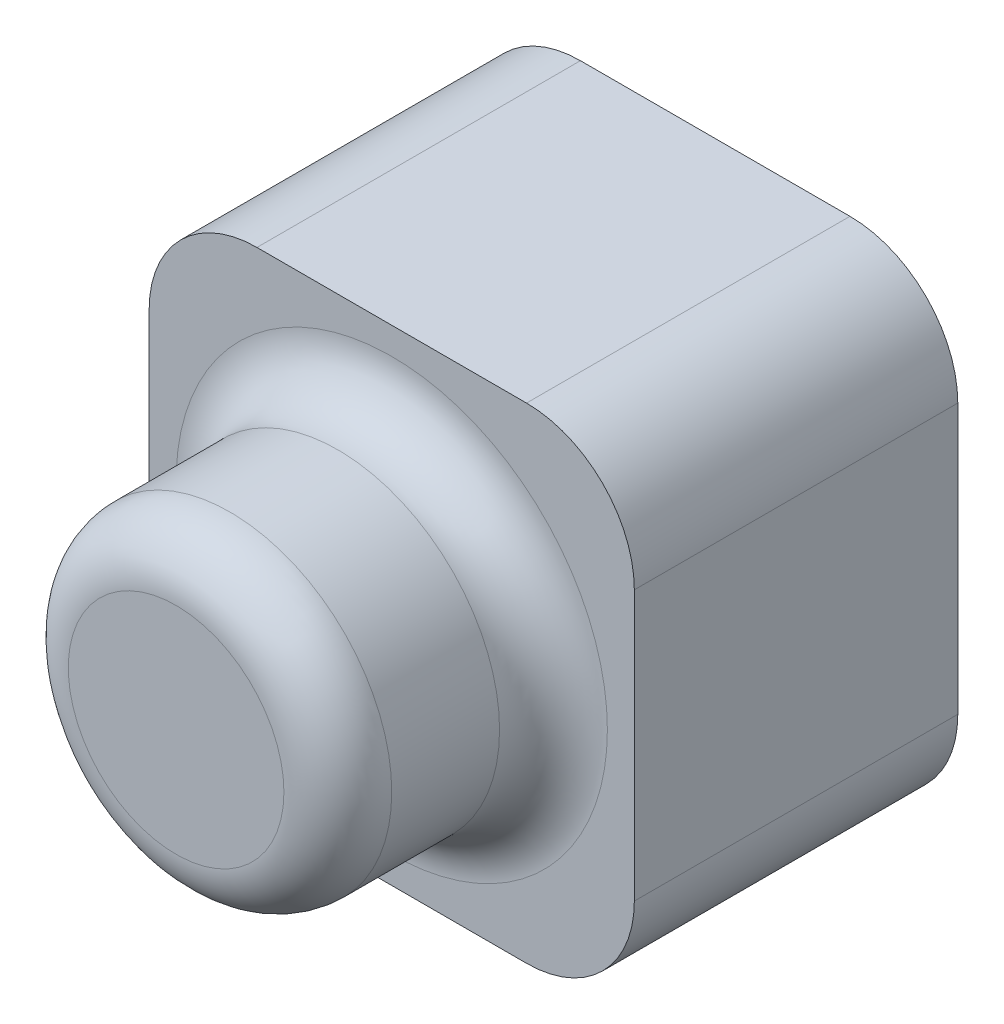
ISO-10303-21;
HEADER;
FILE_DESCRIPTION(('STEP AP214'),'2;1');
FILE_NAME('part.step','',(''),(''),'','','');
FILE_SCHEMA(('AUTOMOTIVE_DESIGN { 1 0 10303 214 1 1 1 1 }'));
ENDSEC;
DATA;
#1=APPLICATION_CONTEXT('core data for automotive mechanical design processes');
#2=APPLICATION_PROTOCOL_DEFINITION('international standard','automotive_design',2000,#1);
#3=PRODUCT_CONTEXT('',#1,'mechanical');
#4=PRODUCT('Part','Part','',(#3));
#5=PRODUCT_RELATED_PRODUCT_CATEGORY('part','',(#4));
#6=PRODUCT_DEFINITION_FORMATION('','',#4);
#7=PRODUCT_DEFINITION_CONTEXT('part definition',#1,'design');
#8=PRODUCT_DEFINITION('design','',#6,#7);
#9=PRODUCT_DEFINITION_SHAPE('','',#8);
#10=(LENGTH_UNIT() NAMED_UNIT(*) SI_UNIT(.MILLI.,.METRE.));
#11=(NAMED_UNIT(*) PLANE_ANGLE_UNIT() SI_UNIT($,.RADIAN.));
#12=(NAMED_UNIT(*) SI_UNIT($,.STERADIAN.) SOLID_ANGLE_UNIT());
#13=UNCERTAINTY_MEASURE_WITH_UNIT(LENGTH_MEASURE(1.E-05),#10,'distance_accuracy_value','');
#14=(GEOMETRIC_REPRESENTATION_CONTEXT(3) GLOBAL_UNCERTAINTY_ASSIGNED_CONTEXT((#13)) GLOBAL_UNIT_ASSIGNED_CONTEXT((#10,
#11,#12)) REPRESENTATION_CONTEXT('',''));
#15=CARTESIAN_POINT('',(0.,0.,0.));
#16=DIRECTION('',(0.,0.,1.));
#17=DIRECTION('',(1.,0.,0.));
#18=AXIS2_PLACEMENT_3D('',#15,#16,#17);
#19=CARTESIAN_POINT('',(-22.5,22.5,30.));
#20=DIRECTION('',(0.,0.,1.));
#21=DIRECTION('',(1.,0.,0.));
#22=AXIS2_PLACEMENT_3D('',#19,#20,#21);
#23=PLANE('',#22);
#24=CARTESIAN_POINT('',(0.,0.,30.));
#25=DIRECTION('',(0.,0.,1.));
#26=DIRECTION('',(1.,0.,0.));
#27=AXIS2_PLACEMENT_3D('',#24,#25,#26);
#28=CIRCLE('',#27,20.);
#29=CARTESIAN_POINT('',(20.,0.,30.));
#30=VERTEX_POINT('',#29);
#31=EDGE_CURVE('E11',#30,#30,#28,.F.);
#32=ORIENTED_EDGE('',*,*,#31,.T.);
#33=EDGE_LOOP('',(#32));
#34=FACE_BOUND('',#33,.T.);
#35=DIRECTION('',(0.,-1.,0.));
#36=VECTOR('',#35,1.);
#37=CARTESIAN_POINT('',(-22.5,-22.5,30.));
#38=LINE('',#37,#36);
#39=CARTESIAN_POINT('',(-22.5,12.5,30.));
#40=VERTEX_POINT('',#39);
#41=CARTESIAN_POINT('',(-22.5,-12.5,30.));
#42=VERTEX_POINT('',#41);
#43=EDGE_CURVE('E217',#40,#42,#38,.T.);
#44=ORIENTED_EDGE('',*,*,#43,.T.);
#45=CARTESIAN_POINT('',(-12.5,-12.5,30.));
#46=DIRECTION('',(0.,0.,1.));
#47=DIRECTION('',(1.,0.,0.));
#48=AXIS2_PLACEMENT_3D('',#45,#46,#47);
#49=CIRCLE('',#48,10.);
#50=CARTESIAN_POINT('',(-12.5,-22.5,30.));
#51=VERTEX_POINT('',#50);
#52=EDGE_CURVE('E263',#42,#51,#49,.T.);
#53=ORIENTED_EDGE('',*,*,#52,.T.);
#54=DIRECTION('',(1.,0.,0.));
#55=VECTOR('',#54,1.);
#56=CARTESIAN_POINT('',(22.5,-22.5,30.));
#57=LINE('',#56,#55);
#58=CARTESIAN_POINT('',(12.5,-22.5,30.));
#59=VERTEX_POINT('',#58);
#60=EDGE_CURVE('E220',#51,#59,#57,.T.);
#61=ORIENTED_EDGE('',*,*,#60,.T.);
#62=CARTESIAN_POINT('',(12.5,-12.5,30.));
#63=DIRECTION('',(0.,0.,1.));
#64=DIRECTION('',(1.,0.,0.));
#65=AXIS2_PLACEMENT_3D('',#62,#63,#64);
#66=CIRCLE('',#65,10.);
#67=CARTESIAN_POINT('',(22.5,-12.5,30.));
#68=VERTEX_POINT('',#67);
#69=EDGE_CURVE('E261',#59,#68,#66,.T.);
#70=ORIENTED_EDGE('',*,*,#69,.T.);
#71=DIRECTION('',(0.,1.,0.));
#72=VECTOR('',#71,1.);
#73=CARTESIAN_POINT('',(22.5,-22.5,30.));
#74=LINE('',#73,#72);
#75=CARTESIAN_POINT('',(22.5,12.5,30.));
#76=VERTEX_POINT('',#75);
#77=EDGE_CURVE('E224',#68,#76,#74,.T.);
#78=ORIENTED_EDGE('',*,*,#77,.T.);
#79=CARTESIAN_POINT('',(12.5,12.5,30.));
#80=DIRECTION('',(0.,0.,1.));
#81=DIRECTION('',(1.,0.,0.));
#82=AXIS2_PLACEMENT_3D('',#79,#80,#81);
#83=CIRCLE('',#82,10.);
#84=CARTESIAN_POINT('',(12.5,22.5,30.));
#85=VERTEX_POINT('',#84);
#86=EDGE_CURVE('E259',#76,#85,#83,.T.);
#87=ORIENTED_EDGE('',*,*,#86,.T.);
#88=DIRECTION('',(-1.,0.,0.));
#89=VECTOR('',#88,1.);
#90=CARTESIAN_POINT('',(22.5,22.5,30.));
#91=LINE('',#90,#89);
#92=CARTESIAN_POINT('',(-12.5,22.5,30.));
#93=VERTEX_POINT('',#92);
#94=EDGE_CURVE('E227',#85,#93,#91,.T.);
#95=ORIENTED_EDGE('',*,*,#94,.T.);
#96=CARTESIAN_POINT('',(-12.5,12.5,30.));
#97=DIRECTION('',(0.,0.,1.));
#98=DIRECTION('',(1.,0.,0.));
#99=AXIS2_PLACEMENT_3D('',#96,#97,#98);
#100=CIRCLE('',#99,10.);
#101=EDGE_CURVE('E257',#93,#40,#100,.T.);
#102=ORIENTED_EDGE('',*,*,#101,.T.);
#103=EDGE_LOOP('',(#44,#53,#61,#70,#78,#87,#95,#102));
#104=FACE_BOUND('',#103,.T.);
#105=ADVANCED_FACE('F32',(#34,#104),#23,.T.);
#106=CARTESIAN_POINT('',(-22.5,-22.5,30.));
#107=DIRECTION('',(1.,0.,0.));
#108=DIRECTION('',(0.,1.,0.));
#109=AXIS2_PLACEMENT_3D('',#106,#107,#108);
#110=PLANE('',#109);
#111=DIRECTION('',(0.,-1.,0.));
#112=VECTOR('',#111,1.);
#113=CARTESIAN_POINT('',(-22.5,-22.5,0.));
#114=LINE('',#113,#112);
#115=CARTESIAN_POINT('',(-22.5,12.5,0.));
#116=VERTEX_POINT('',#115);
#117=CARTESIAN_POINT('',(-22.5,-12.5,0.));
#118=VERTEX_POINT('',#117);
#119=EDGE_CURVE('E230',#116,#118,#114,.T.);
#120=ORIENTED_EDGE('',*,*,#119,.T.);
#121=DIRECTION('',(0.,0.,-1.));
#122=VECTOR('',#121,1.);
#123=CARTESIAN_POINT('',(-22.5,-12.5,30.));
#124=LINE('',#123,#122);
#125=EDGE_CURVE('E255',#118,#42,#124,.F.);
#126=ORIENTED_EDGE('',*,*,#125,.T.);
#127=ORIENTED_EDGE('',*,*,#43,.F.);
#128=DIRECTION('',(0.,0.,-1.));
#129=VECTOR('',#128,1.);
#130=CARTESIAN_POINT('',(-22.5,12.5,30.));
#131=LINE('',#130,#129);
#132=EDGE_CURVE('E252',#40,#116,#131,.T.);
#133=ORIENTED_EDGE('',*,*,#132,.T.);
#134=EDGE_LOOP('',(#120,#126,#127,#133));
#135=FACE_BOUND('',#134,.T.);
#136=ADVANCED_FACE('F300',(#135),#110,.F.);
#137=CARTESIAN_POINT('',(22.5,-22.5,30.));
#138=DIRECTION('',(0.,1.,0.));
#139=DIRECTION('',(-1.,0.,0.));
#140=AXIS2_PLACEMENT_3D('',#137,#138,#139);
#141=PLANE('',#140);
#142=ORIENTED_EDGE('',*,*,#60,.F.);
#143=DIRECTION('',(0.,0.,-1.));
#144=VECTOR('',#143,1.);
#145=CARTESIAN_POINT('',(-12.5,-22.5,30.));
#146=LINE('',#145,#144);
#147=CARTESIAN_POINT('',(-12.5,-22.5,0.));
#148=VERTEX_POINT('',#147);
#149=EDGE_CURVE('E241',#51,#148,#146,.T.);
#150=ORIENTED_EDGE('',*,*,#149,.T.);
#151=DIRECTION('',(1.,0.,0.));
#152=VECTOR('',#151,1.);
#153=CARTESIAN_POINT('',(22.5,-22.5,0.));
#154=LINE('',#153,#152);
#155=CARTESIAN_POINT('',(12.5,-22.5,0.));
#156=VERTEX_POINT('',#155);
#157=EDGE_CURVE('E233',#148,#156,#154,.T.);
#158=ORIENTED_EDGE('',*,*,#157,.T.);
#159=DIRECTION('',(0.,0.,-1.));
#160=VECTOR('',#159,1.);
#161=CARTESIAN_POINT('',(12.5,-22.5,30.));
#162=LINE('',#161,#160);
#163=EDGE_CURVE('E229',#156,#59,#162,.F.);
#164=ORIENTED_EDGE('',*,*,#163,.T.);
#165=EDGE_LOOP('',(#142,#150,#158,#164));
#166=FACE_BOUND('',#165,.T.);
#167=ADVANCED_FACE('F306',(#166),#141,.F.);
#168=CARTESIAN_POINT('',(22.5,-22.5,30.));
#169=DIRECTION('',(-1.,0.,0.));
#170=DIRECTION('',(0.,0.,1.));
#171=AXIS2_PLACEMENT_3D('',#168,#169,#170);
#172=PLANE('',#171);
#173=ORIENTED_EDGE('',*,*,#77,.F.);
#174=DIRECTION('',(0.,0.,-1.));
#175=VECTOR('',#174,1.);
#176=CARTESIAN_POINT('',(22.5,-12.5,30.));
#177=LINE('',#176,#175);
#178=CARTESIAN_POINT('',(22.5,-12.5,0.));
#179=VERTEX_POINT('',#178);
#180=EDGE_CURVE('E267',#68,#179,#177,.T.);
#181=ORIENTED_EDGE('',*,*,#180,.T.);
#182=DIRECTION('',(0.,1.,0.));
#183=VECTOR('',#182,1.);
#184=CARTESIAN_POINT('',(22.5,-22.5,0.));
#185=LINE('',#184,#183);
#186=CARTESIAN_POINT('',(22.5,12.5,0.));
#187=VERTEX_POINT('',#186);
#188=EDGE_CURVE('E236',#179,#187,#185,.T.);
#189=ORIENTED_EDGE('',*,*,#188,.T.);
#190=DIRECTION('',(0.,0.,-1.));
#191=VECTOR('',#190,1.);
#192=CARTESIAN_POINT('',(22.5,12.5,30.));
#193=LINE('',#192,#191);
#194=EDGE_CURVE('E265',#187,#76,#193,.F.);
#195=ORIENTED_EDGE('',*,*,#194,.T.);
#196=EDGE_LOOP('',(#173,#181,#189,#195));
#197=FACE_BOUND('',#196,.T.);
#198=ADVANCED_FACE('F319',(#197),#172,.F.);
#199=CARTESIAN_POINT('',(22.5,22.5,30.));
#200=DIRECTION('',(0.,-1.,0.));
#201=DIRECTION('',(1.,0.,0.));
#202=AXIS2_PLACEMENT_3D('',#199,#200,#201);
#203=PLANE('',#202);
#204=ORIENTED_EDGE('',*,*,#94,.F.);
#205=DIRECTION('',(0.,0.,-1.));
#206=VECTOR('',#205,1.);
#207=CARTESIAN_POINT('',(12.5,22.5,30.));
#208=LINE('',#207,#206);
#209=CARTESIAN_POINT('',(12.5,22.5,0.));
#210=VERTEX_POINT('',#209);
#211=EDGE_CURVE('E271',#85,#210,#208,.T.);
#212=ORIENTED_EDGE('',*,*,#211,.T.);
#213=DIRECTION('',(-1.,0.,0.));
#214=VECTOR('',#213,1.);
#215=CARTESIAN_POINT('',(22.5,22.5,0.));
#216=LINE('',#215,#214);
#217=CARTESIAN_POINT('',(-12.5,22.5,0.));
#218=VERTEX_POINT('',#217);
#219=EDGE_CURVE('E221',#210,#218,#216,.T.);
#220=ORIENTED_EDGE('',*,*,#219,.T.);
#221=DIRECTION('',(0.,0.,-1.));
#222=VECTOR('',#221,1.);
#223=CARTESIAN_POINT('',(-12.5,22.5,30.));
#224=LINE('',#223,#222);
#225=EDGE_CURVE('E55',#218,#93,#224,.F.);
#226=ORIENTED_EDGE('',*,*,#225,.T.);
#227=EDGE_LOOP('',(#204,#212,#220,#226));
#228=FACE_BOUND('',#227,.T.);
#229=ADVANCED_FACE('F315',(#228),#203,.F.);
#230=CARTESIAN_POINT('',(-22.5,22.5,0.));
#231=DIRECTION('',(0.,0.,1.));
#232=DIRECTION('',(1.,0.,0.));
#233=AXIS2_PLACEMENT_3D('',#230,#231,#232);
#234=PLANE('',#233);
#235=CARTESIAN_POINT('',(-12.5,-12.5,0.));
#236=DIRECTION('',(0.,0.,1.));
#237=DIRECTION('',(1.,0.,0.));
#238=AXIS2_PLACEMENT_3D('',#235,#236,#237);
#239=CIRCLE('',#238,9.);
#240=CARTESIAN_POINT('',(-12.5,-21.5,0.));
#241=VERTEX_POINT('',#240);
#242=CARTESIAN_POINT('',(-21.5,-12.5,0.));
#243=VERTEX_POINT('',#242);
#244=EDGE_CURVE('E214',#241,#243,#239,.F.);
#245=ORIENTED_EDGE('',*,*,#244,.F.);
#246=DIRECTION('',(1.,0.,0.));
#247=VECTOR('',#246,1.);
#248=CARTESIAN_POINT('',(22.5,-21.5,0.));
#249=LINE('',#248,#247);
#250=CARTESIAN_POINT('',(12.5,-21.5,0.));
#251=VERTEX_POINT('',#250);
#252=EDGE_CURVE('E174',#241,#251,#249,.T.);
#253=ORIENTED_EDGE('',*,*,#252,.T.);
#254=CARTESIAN_POINT('',(12.5,-12.5,0.));
#255=DIRECTION('',(0.,0.,1.));
#256=DIRECTION('',(1.,0.,0.));
#257=AXIS2_PLACEMENT_3D('',#254,#255,#256);
#258=CIRCLE('',#257,9.);
#259=CARTESIAN_POINT('',(21.5,-12.5,0.));
#260=VERTEX_POINT('',#259);
#261=EDGE_CURVE('E211',#260,#251,#258,.F.);
#262=ORIENTED_EDGE('',*,*,#261,.F.);
#263=DIRECTION('',(0.,1.,0.));
#264=VECTOR('',#263,1.);
#265=CARTESIAN_POINT('',(21.5,-22.5,0.));
#266=LINE('',#265,#264);
#267=CARTESIAN_POINT('',(21.5,12.5,0.));
#268=VERTEX_POINT('',#267);
#269=EDGE_CURVE('E47',#260,#268,#266,.T.);
#270=ORIENTED_EDGE('',*,*,#269,.T.);
#271=CARTESIAN_POINT('',(12.5,12.5,0.));
#272=DIRECTION('',(0.,0.,1.));
#273=DIRECTION('',(1.,0.,0.));
#274=AXIS2_PLACEMENT_3D('',#271,#272,#273);
#275=CIRCLE('',#274,9.);
#276=CARTESIAN_POINT('',(12.5,21.5,0.));
#277=VERTEX_POINT('',#276);
#278=EDGE_CURVE('E179',#277,#268,#275,.F.);
#279=ORIENTED_EDGE('',*,*,#278,.F.);
#280=DIRECTION('',(-1.,0.,0.));
#281=VECTOR('',#280,1.);
#282=CARTESIAN_POINT('',(22.5,21.5,0.));
#283=LINE('',#282,#281);
#284=CARTESIAN_POINT('',(-12.5,21.5,0.));
#285=VERTEX_POINT('',#284);
#286=EDGE_CURVE('E207',#277,#285,#283,.T.);
#287=ORIENTED_EDGE('',*,*,#286,.T.);
#288=CARTESIAN_POINT('',(-12.5,12.5,0.));
#289=DIRECTION('',(0.,0.,1.));
#290=DIRECTION('',(1.,0.,0.));
#291=AXIS2_PLACEMENT_3D('',#288,#289,#290);
#292=CIRCLE('',#291,9.);
#293=CARTESIAN_POINT('',(-21.5,12.5,0.));
#294=VERTEX_POINT('',#293);
#295=EDGE_CURVE('E176',#294,#285,#292,.F.);
#296=ORIENTED_EDGE('',*,*,#295,.F.);
#297=DIRECTION('',(0.,-1.,0.));
#298=VECTOR('',#297,1.);
#299=CARTESIAN_POINT('',(-21.5,-22.5,0.));
#300=LINE('',#299,#298);
#301=EDGE_CURVE('E204',#294,#243,#300,.T.);
#302=ORIENTED_EDGE('',*,*,#301,.T.);
#303=EDGE_LOOP('',(#245,#253,#262,#270,#279,#287,#296,#302));
#304=FACE_BOUND('',#303,.T.);
#305=ORIENTED_EDGE('',*,*,#157,.F.);
#306=CARTESIAN_POINT('',(-12.5,-12.5,0.));
#307=DIRECTION('',(0.,0.,1.));
#308=DIRECTION('',(1.,0.,0.));
#309=AXIS2_PLACEMENT_3D('',#306,#307,#308);
#310=CIRCLE('',#309,10.);
#311=EDGE_CURVE('E250',#148,#118,#310,.F.);
#312=ORIENTED_EDGE('',*,*,#311,.T.);
#313=ORIENTED_EDGE('',*,*,#119,.F.);
#314=CARTESIAN_POINT('',(-12.5,12.5,0.));
#315=DIRECTION('',(0.,0.,1.));
#316=DIRECTION('',(1.,0.,0.));
#317=AXIS2_PLACEMENT_3D('',#314,#315,#316);
#318=CIRCLE('',#317,10.);
#319=EDGE_CURVE('E244',#116,#218,#318,.F.);
#320=ORIENTED_EDGE('',*,*,#319,.T.);
#321=ORIENTED_EDGE('',*,*,#219,.F.);
#322=CARTESIAN_POINT('',(12.5,12.5,0.));
#323=DIRECTION('',(0.,0.,1.));
#324=DIRECTION('',(1.,0.,0.));
#325=AXIS2_PLACEMENT_3D('',#322,#323,#324);
#326=CIRCLE('',#325,10.);
#327=EDGE_CURVE('E246',#210,#187,#326,.F.);
#328=ORIENTED_EDGE('',*,*,#327,.T.);
#329=ORIENTED_EDGE('',*,*,#188,.F.);
#330=CARTESIAN_POINT('',(12.5,-12.5,0.));
#331=DIRECTION('',(0.,0.,1.));
#332=DIRECTION('',(1.,0.,0.));
#333=AXIS2_PLACEMENT_3D('',#330,#331,#332);
#334=CIRCLE('',#333,10.);
#335=EDGE_CURVE('E248',#179,#156,#334,.F.);
#336=ORIENTED_EDGE('',*,*,#335,.T.);
#337=EDGE_LOOP('',(#305,#312,#313,#320,#321,#328,#329,#336));
#338=FACE_BOUND('',#337,.T.);
#339=ADVANCED_FACE('F311',(#304,#338),#234,.F.);
#340=CARTESIAN_POINT('',(-12.5,-12.5,30.));
#341=DIRECTION('',(0.,0.,-1.));
#342=DIRECTION('',(-1.,0.,0.));
#343=AXIS2_PLACEMENT_3D('',#340,#341,#342);
#344=CYLINDRICAL_SURFACE('',#343,10.);
#345=ORIENTED_EDGE('',*,*,#52,.F.);
#346=ORIENTED_EDGE('',*,*,#125,.F.);
#347=ORIENTED_EDGE('',*,*,#311,.F.);
#348=ORIENTED_EDGE('',*,*,#149,.F.);
#349=EDGE_LOOP('',(#345,#346,#347,#348));
#350=FACE_BOUND('',#349,.T.);
#351=ADVANCED_FACE('F314',(#350),#344,.T.);
#352=CARTESIAN_POINT('',(12.5,-12.5,30.));
#353=DIRECTION('',(0.,0.,-1.));
#354=DIRECTION('',(-1.,0.,0.));
#355=AXIS2_PLACEMENT_3D('',#352,#353,#354);
#356=CYLINDRICAL_SURFACE('',#355,10.);
#357=ORIENTED_EDGE('',*,*,#69,.F.);
#358=ORIENTED_EDGE('',*,*,#163,.F.);
#359=ORIENTED_EDGE('',*,*,#335,.F.);
#360=ORIENTED_EDGE('',*,*,#180,.F.);
#361=EDGE_LOOP('',(#357,#358,#359,#360));
#362=FACE_BOUND('',#361,.T.);
#363=ADVANCED_FACE('F328',(#362),#356,.T.);
#364=CARTESIAN_POINT('',(12.5,12.5,30.));
#365=DIRECTION('',(0.,0.,-1.));
#366=DIRECTION('',(-1.,0.,0.));
#367=AXIS2_PLACEMENT_3D('',#364,#365,#366);
#368=CYLINDRICAL_SURFACE('',#367,10.);
#369=ORIENTED_EDGE('',*,*,#86,.F.);
#370=ORIENTED_EDGE('',*,*,#194,.F.);
#371=ORIENTED_EDGE('',*,*,#327,.F.);
#372=ORIENTED_EDGE('',*,*,#211,.F.);
#373=EDGE_LOOP('',(#369,#370,#371,#372));
#374=FACE_BOUND('',#373,.T.);
#375=ADVANCED_FACE('F332',(#374),#368,.T.);
#376=CARTESIAN_POINT('',(-12.5,12.5,30.));
#377=DIRECTION('',(0.,0.,-1.));
#378=DIRECTION('',(-1.,0.,0.));
#379=AXIS2_PLACEMENT_3D('',#376,#377,#378);
#380=CYLINDRICAL_SURFACE('',#379,10.);
#381=ORIENTED_EDGE('',*,*,#101,.F.);
#382=ORIENTED_EDGE('',*,*,#225,.F.);
#383=ORIENTED_EDGE('',*,*,#319,.F.);
#384=ORIENTED_EDGE('',*,*,#132,.F.);
#385=EDGE_LOOP('',(#381,#382,#383,#384));
#386=FACE_BOUND('',#385,.T.);
#387=ADVANCED_FACE('F296',(#386),#380,.T.);
#388=CARTESIAN_POINT('',(0.,0.,50.));
#389=DIRECTION('',(0.,0.,-1.));
#390=DIRECTION('',(-1.,0.,0.));
#391=AXIS2_PLACEMENT_3D('',#388,#389,#390);
#392=CYLINDRICAL_SURFACE('',#391,15.);
#393=CARTESIAN_POINT('',(0.,0.,45.));
#394=DIRECTION('',(0.,0.,1.));
#395=DIRECTION('',(1.,0.,0.));
#396=AXIS2_PLACEMENT_3D('',#393,#394,#395);
#397=CIRCLE('',#396,15.);
#398=CARTESIAN_POINT('',(15.,0.,45.));
#399=VERTEX_POINT('',#398);
#400=EDGE_CURVE('E40',#399,#399,#397,.F.);
#401=ORIENTED_EDGE('',*,*,#400,.T.);
#402=EDGE_LOOP('',(#401));
#403=FACE_BOUND('',#402,.T.);
#404=CARTESIAN_POINT('',(0.,0.,35.));
#405=DIRECTION('',(0.,0.,1.));
#406=DIRECTION('',(1.,0.,0.));
#407=AXIS2_PLACEMENT_3D('',#404,#405,#406);
#408=CIRCLE('',#407,15.);
#409=CARTESIAN_POINT('',(15.,0.,35.));
#410=VERTEX_POINT('',#409);
#411=EDGE_CURVE('E277',#410,#410,#408,.T.);
#412=ORIENTED_EDGE('',*,*,#411,.T.);
#413=EDGE_LOOP('',(#412));
#414=FACE_BOUND('',#413,.T.);
#415=ADVANCED_FACE('F282',(#403,#414),#392,.T.);
#416=CARTESIAN_POINT('',(0.,0.,50.));
#417=DIRECTION('',(0.,0.,1.));
#418=DIRECTION('',(1.,0.,0.));
#419=AXIS2_PLACEMENT_3D('',#416,#417,#418);
#420=PLANE('',#419);
#421=CARTESIAN_POINT('',(0.,0.,50.));
#422=DIRECTION('',(0.,0.,1.));
#423=DIRECTION('',(1.,0.,0.));
#424=AXIS2_PLACEMENT_3D('',#421,#422,#423);
#425=CIRCLE('',#424,10.);
#426=CARTESIAN_POINT('',(10.,0.,50.));
#427=VERTEX_POINT('',#426);
#428=EDGE_CURVE('E274',#427,#427,#425,.T.);
#429=ORIENTED_EDGE('',*,*,#428,.T.);
#430=EDGE_LOOP('',(#429));
#431=FACE_BOUND('',#430,.T.);
#432=ADVANCED_FACE('F288',(#431),#420,.T.);
#433=CARTESIAN_POINT('',(0.,0.,45.));
#434=DIRECTION('',(0.,0.,1.));
#435=DIRECTION('',(1.,0.,0.));
#436=AXIS2_PLACEMENT_3D('',#433,#434,#435);
#437=TOROIDAL_SURFACE('',#436,10.,5.);
#438=ORIENTED_EDGE('',*,*,#400,.F.);
#439=EDGE_LOOP('',(#438));
#440=FACE_BOUND('',#439,.T.);
#441=ORIENTED_EDGE('',*,*,#428,.F.);
#442=EDGE_LOOP('',(#441));
#443=FACE_BOUND('',#442,.T.);
#444=ADVANCED_FACE('F285',(#440,#443),#437,.T.);
#445=CARTESIAN_POINT('',(0.,0.,35.));
#446=DIRECTION('',(0.,0.,1.));
#447=DIRECTION('',(1.,0.,0.));
#448=AXIS2_PLACEMENT_3D('',#445,#446,#447);
#449=TOROIDAL_SURFACE('',#448,20.,5.);
#450=ORIENTED_EDGE('',*,*,#31,.F.);
#451=EDGE_LOOP('',(#450));
#452=FACE_BOUND('',#451,.T.);
#453=ORIENTED_EDGE('',*,*,#411,.F.);
#454=EDGE_LOOP('',(#453));
#455=FACE_BOUND('',#454,.T.);
#456=ADVANCED_FACE('F34',(#452,#455),#449,.F.);
#457=CARTESIAN_POINT('',(-22.5,22.5,29.));
#458=DIRECTION('',(0.,0.,1.));
#459=DIRECTION('',(1.,0.,0.));
#460=AXIS2_PLACEMENT_3D('',#457,#458,#459);
#461=PLANE('',#460);
#462=CARTESIAN_POINT('',(0.,0.,29.));
#463=DIRECTION('',(0.,0.,1.));
#464=DIRECTION('',(1.,0.,0.));
#465=AXIS2_PLACEMENT_3D('',#462,#463,#464);
#466=CIRCLE('',#465,20.);
#467=CARTESIAN_POINT('',(20.,0.,29.));
#468=VERTEX_POINT('',#467);
#469=EDGE_CURVE('E201',#468,#468,#466,.F.);
#470=ORIENTED_EDGE('',*,*,#469,.F.);
#471=EDGE_LOOP('',(#470));
#472=FACE_BOUND('',#471,.T.);
#473=DIRECTION('',(0.,-1.,0.));
#474=VECTOR('',#473,1.);
#475=CARTESIAN_POINT('',(-21.5,-22.5,29.));
#476=LINE('',#475,#474);
#477=CARTESIAN_POINT('',(-21.5,12.5,29.));
#478=VERTEX_POINT('',#477);
#479=CARTESIAN_POINT('',(-21.5,-12.5,29.));
#480=VERTEX_POINT('',#479);
#481=EDGE_CURVE('E170',#478,#480,#476,.T.);
#482=ORIENTED_EDGE('',*,*,#481,.F.);
#483=CARTESIAN_POINT('',(-12.5,12.5,29.));
#484=DIRECTION('',(0.,0.,1.));
#485=DIRECTION('',(1.,0.,0.));
#486=AXIS2_PLACEMENT_3D('',#483,#484,#485);
#487=CIRCLE('',#486,9.);
#488=CARTESIAN_POINT('',(-12.5,21.5,29.));
#489=VERTEX_POINT('',#488);
#490=EDGE_CURVE('E545',#489,#478,#487,.T.);
#491=ORIENTED_EDGE('',*,*,#490,.F.);
#492=DIRECTION('',(-1.,0.,0.));
#493=VECTOR('',#492,1.);
#494=CARTESIAN_POINT('',(22.5,21.5,29.));
#495=LINE('',#494,#493);
#496=CARTESIAN_POINT('',(12.5,21.5,29.));
#497=VERTEX_POINT('',#496);
#498=EDGE_CURVE('E181',#497,#489,#495,.T.);
#499=ORIENTED_EDGE('',*,*,#498,.F.);
#500=CARTESIAN_POINT('',(12.5,12.5,29.));
#501=DIRECTION('',(0.,0.,1.));
#502=DIRECTION('',(1.,0.,0.));
#503=AXIS2_PLACEMENT_3D('',#500,#501,#502);
#504=CIRCLE('',#503,9.);
#505=CARTESIAN_POINT('',(21.5,12.5,29.));
#506=VERTEX_POINT('',#505);
#507=EDGE_CURVE('E541',#506,#497,#504,.T.);
#508=ORIENTED_EDGE('',*,*,#507,.F.);
#509=DIRECTION('',(0.,1.,0.));
#510=VECTOR('',#509,1.);
#511=CARTESIAN_POINT('',(21.5,-22.5,29.));
#512=LINE('',#511,#510);
#513=CARTESIAN_POINT('',(21.5,-12.5,29.));
#514=VERTEX_POINT('',#513);
#515=EDGE_CURVE('E169',#514,#506,#512,.T.);
#516=ORIENTED_EDGE('',*,*,#515,.F.);
#517=CARTESIAN_POINT('',(12.5,-12.5,29.));
#518=DIRECTION('',(0.,0.,1.));
#519=DIRECTION('',(1.,0.,0.));
#520=AXIS2_PLACEMENT_3D('',#517,#518,#519);
#521=CIRCLE('',#520,9.);
#522=CARTESIAN_POINT('',(12.5,-21.5,29.));
#523=VERTEX_POINT('',#522);
#524=EDGE_CURVE('E160',#523,#514,#521,.T.);
#525=ORIENTED_EDGE('',*,*,#524,.F.);
#526=DIRECTION('',(1.,0.,0.));
#527=VECTOR('',#526,1.);
#528=CARTESIAN_POINT('',(22.5,-21.5,29.));
#529=LINE('',#528,#527);
#530=CARTESIAN_POINT('',(-12.5,-21.5,29.));
#531=VERTEX_POINT('',#530);
#532=EDGE_CURVE('E164',#531,#523,#529,.T.);
#533=ORIENTED_EDGE('',*,*,#532,.F.);
#534=CARTESIAN_POINT('',(-12.5,-12.5,29.));
#535=DIRECTION('',(0.,0.,1.));
#536=DIRECTION('',(1.,0.,0.));
#537=AXIS2_PLACEMENT_3D('',#534,#535,#536);
#538=CIRCLE('',#537,9.);
#539=EDGE_CURVE('E148',#480,#531,#538,.T.);
#540=ORIENTED_EDGE('',*,*,#539,.F.);
#541=EDGE_LOOP('',(#482,#491,#499,#508,#516,#525,#533,#540));
#542=FACE_BOUND('',#541,.T.);
#543=ADVANCED_FACE('F165',(#472,#542),#461,.F.);
#544=CARTESIAN_POINT('',(-21.5,-22.5,30.));
#545=DIRECTION('',(1.,0.,0.));
#546=DIRECTION('',(0.,1.,0.));
#547=AXIS2_PLACEMENT_3D('',#544,#545,#546);
#548=PLANE('',#547);
#549=ORIENTED_EDGE('',*,*,#301,.F.);
#550=DIRECTION('',(0.,0.,1.));
#551=VECTOR('',#550,1.);
#552=CARTESIAN_POINT('',(-21.5,12.5,30.));
#553=LINE('',#552,#551);
#554=EDGE_CURVE('E184',#478,#294,#553,.F.);
#555=ORIENTED_EDGE('',*,*,#554,.F.);
#556=ORIENTED_EDGE('',*,*,#481,.T.);
#557=DIRECTION('',(0.,0.,1.));
#558=VECTOR('',#557,1.);
#559=CARTESIAN_POINT('',(-21.5,-12.5,30.));
#560=LINE('',#559,#558);
#561=EDGE_CURVE('E155',#243,#480,#560,.T.);
#562=ORIENTED_EDGE('',*,*,#561,.F.);
#563=EDGE_LOOP('',(#549,#555,#556,#562));
#564=FACE_BOUND('',#563,.T.);
#565=ADVANCED_FACE('F405',(#564),#548,.T.);
#566=CARTESIAN_POINT('',(22.5,-21.5,30.));
#567=DIRECTION('',(0.,1.,0.));
#568=DIRECTION('',(-1.,0.,0.));
#569=AXIS2_PLACEMENT_3D('',#566,#567,#568);
#570=PLANE('',#569);
#571=ORIENTED_EDGE('',*,*,#532,.T.);
#572=DIRECTION('',(0.,0.,1.));
#573=VECTOR('',#572,1.);
#574=CARTESIAN_POINT('',(12.5,-21.5,30.));
#575=LINE('',#574,#573);
#576=EDGE_CURVE('E177',#251,#523,#575,.T.);
#577=ORIENTED_EDGE('',*,*,#576,.F.);
#578=ORIENTED_EDGE('',*,*,#252,.F.);
#579=DIRECTION('',(0.,0.,1.));
#580=VECTOR('',#579,1.);
#581=CARTESIAN_POINT('',(-12.5,-21.5,30.));
#582=LINE('',#581,#580);
#583=EDGE_CURVE('E152',#531,#241,#582,.F.);
#584=ORIENTED_EDGE('',*,*,#583,.F.);
#585=EDGE_LOOP('',(#571,#577,#578,#584));
#586=FACE_BOUND('',#585,.T.);
#587=ADVANCED_FACE('F172',(#586),#570,.T.);
#588=CARTESIAN_POINT('',(21.5,-22.5,30.));
#589=DIRECTION('',(-1.,0.,0.));
#590=DIRECTION('',(0.,0.,1.));
#591=AXIS2_PLACEMENT_3D('',#588,#589,#590);
#592=PLANE('',#591);
#593=ORIENTED_EDGE('',*,*,#515,.T.);
#594=DIRECTION('',(0.,0.,1.));
#595=VECTOR('',#594,1.);
#596=CARTESIAN_POINT('',(21.5,12.5,30.));
#597=LINE('',#596,#595);
#598=EDGE_CURVE('E159',#268,#506,#597,.T.);
#599=ORIENTED_EDGE('',*,*,#598,.F.);
#600=ORIENTED_EDGE('',*,*,#269,.F.);
#601=DIRECTION('',(0.,0.,1.));
#602=VECTOR('',#601,1.);
#603=CARTESIAN_POINT('',(21.5,-12.5,30.));
#604=LINE('',#603,#602);
#605=EDGE_CURVE('E187',#514,#260,#604,.F.);
#606=ORIENTED_EDGE('',*,*,#605,.F.);
#607=EDGE_LOOP('',(#593,#599,#600,#606));
#608=FACE_BOUND('',#607,.T.);
#609=ADVANCED_FACE('F424',(#608),#592,.T.);
#610=CARTESIAN_POINT('',(22.5,21.5,30.));
#611=DIRECTION('',(0.,-1.,0.));
#612=DIRECTION('',(1.,0.,0.));
#613=AXIS2_PLACEMENT_3D('',#610,#611,#612);
#614=PLANE('',#613);
#615=ORIENTED_EDGE('',*,*,#498,.T.);
#616=DIRECTION('',(0.,0.,1.));
#617=VECTOR('',#616,1.);
#618=CARTESIAN_POINT('',(-12.5,21.5,30.));
#619=LINE('',#618,#617);
#620=EDGE_CURVE('E189',#285,#489,#619,.T.);
#621=ORIENTED_EDGE('',*,*,#620,.F.);
#622=ORIENTED_EDGE('',*,*,#286,.F.);
#623=DIRECTION('',(0.,0.,1.));
#624=VECTOR('',#623,1.);
#625=CARTESIAN_POINT('',(12.5,21.5,30.));
#626=LINE('',#625,#624);
#627=EDGE_CURVE('E191',#497,#277,#626,.F.);
#628=ORIENTED_EDGE('',*,*,#627,.F.);
#629=EDGE_LOOP('',(#615,#621,#622,#628));
#630=FACE_BOUND('',#629,.T.);
#631=ADVANCED_FACE('F433',(#630),#614,.T.);
#632=CARTESIAN_POINT('',(-12.5,-12.5,30.));
#633=DIRECTION('',(0.,0.,-1.));
#634=DIRECTION('',(-1.,0.,0.));
#635=AXIS2_PLACEMENT_3D('',#632,#633,#634);
#636=CYLINDRICAL_SURFACE('',#635,9.);
#637=ORIENTED_EDGE('',*,*,#539,.T.);
#638=ORIENTED_EDGE('',*,*,#583,.T.);
#639=ORIENTED_EDGE('',*,*,#244,.T.);
#640=ORIENTED_EDGE('',*,*,#561,.T.);
#641=EDGE_LOOP('',(#637,#638,#639,#640));
#642=FACE_BOUND('',#641,.T.);
#643=ADVANCED_FACE('F150',(#642),#636,.F.);
#644=CARTESIAN_POINT('',(12.5,-12.5,30.));
#645=DIRECTION('',(0.,0.,-1.));
#646=DIRECTION('',(-1.,0.,0.));
#647=AXIS2_PLACEMENT_3D('',#644,#645,#646);
#648=CYLINDRICAL_SURFACE('',#647,9.);
#649=ORIENTED_EDGE('',*,*,#524,.T.);
#650=ORIENTED_EDGE('',*,*,#605,.T.);
#651=ORIENTED_EDGE('',*,*,#261,.T.);
#652=ORIENTED_EDGE('',*,*,#576,.T.);
#653=EDGE_LOOP('',(#649,#650,#651,#652));
#654=FACE_BOUND('',#653,.T.);
#655=ADVANCED_FACE('F451',(#654),#648,.F.);
#656=CARTESIAN_POINT('',(12.5,12.5,30.));
#657=DIRECTION('',(0.,0.,-1.));
#658=DIRECTION('',(-1.,0.,0.));
#659=AXIS2_PLACEMENT_3D('',#656,#657,#658);
#660=CYLINDRICAL_SURFACE('',#659,9.);
#661=ORIENTED_EDGE('',*,*,#507,.T.);
#662=ORIENTED_EDGE('',*,*,#627,.T.);
#663=ORIENTED_EDGE('',*,*,#278,.T.);
#664=ORIENTED_EDGE('',*,*,#598,.T.);
#665=EDGE_LOOP('',(#661,#662,#663,#664));
#666=FACE_BOUND('',#665,.T.);
#667=ADVANCED_FACE('F460',(#666),#660,.F.);
#668=CARTESIAN_POINT('',(-12.5,12.5,30.));
#669=DIRECTION('',(0.,0.,-1.));
#670=DIRECTION('',(-1.,0.,0.));
#671=AXIS2_PLACEMENT_3D('',#668,#669,#670);
#672=CYLINDRICAL_SURFACE('',#671,9.);
#673=ORIENTED_EDGE('',*,*,#490,.T.);
#674=ORIENTED_EDGE('',*,*,#554,.T.);
#675=ORIENTED_EDGE('',*,*,#295,.T.);
#676=ORIENTED_EDGE('',*,*,#620,.T.);
#677=EDGE_LOOP('',(#673,#674,#675,#676));
#678=FACE_BOUND('',#677,.T.);
#679=ADVANCED_FACE('F470',(#678),#672,.F.);
#680=CARTESIAN_POINT('',(0.,0.,50.));
#681=DIRECTION('',(0.,0.,-1.));
#682=DIRECTION('',(-1.,0.,0.));
#683=AXIS2_PLACEMENT_3D('',#680,#681,#682);
#684=CYLINDRICAL_SURFACE('',#683,14.);
#685=CARTESIAN_POINT('',(0.,0.,45.));
#686=DIRECTION('',(0.,0.,-1.));
#687=DIRECTION('',(-1.,0.,0.));
#688=AXIS2_PLACEMENT_3D('',#685,#686,#687);
#689=CIRCLE('',#688,14.);
#690=CARTESIAN_POINT('',(-14.,0.,45.));
#691=VERTEX_POINT('',#690);
#692=EDGE_CURVE('E198',#691,#691,#689,.T.);
#693=ORIENTED_EDGE('',*,*,#692,.F.);
#694=EDGE_LOOP('',(#693));
#695=FACE_BOUND('',#694,.T.);
#696=CARTESIAN_POINT('',(0.,0.,35.));
#697=DIRECTION('',(0.,0.,-1.));
#698=DIRECTION('',(-1.,0.,0.));
#699=AXIS2_PLACEMENT_3D('',#696,#697,#698);
#700=CIRCLE('',#699,14.);
#701=CARTESIAN_POINT('',(-14.,0.,35.));
#702=VERTEX_POINT('',#701);
#703=EDGE_CURVE('E195',#702,#702,#700,.F.);
#704=ORIENTED_EDGE('',*,*,#703,.F.);
#705=EDGE_LOOP('',(#704));
#706=FACE_BOUND('',#705,.T.);
#707=ADVANCED_FACE('F480',(#695,#706),#684,.F.);
#708=CARTESIAN_POINT('',(0.,0.,49.));
#709=DIRECTION('',(0.,0.,1.));
#710=DIRECTION('',(1.,0.,0.));
#711=AXIS2_PLACEMENT_3D('',#708,#709,#710);
#712=PLANE('',#711);
#713=CARTESIAN_POINT('',(0.,0.,49.));
#714=DIRECTION('',(0.,0.,1.));
#715=DIRECTION('',(1.,0.,0.));
#716=AXIS2_PLACEMENT_3D('',#713,#714,#715);
#717=CIRCLE('',#716,10.);
#718=CARTESIAN_POINT('',(10.,0.,49.));
#719=VERTEX_POINT('',#718);
#720=EDGE_CURVE('E193',#719,#719,#717,.T.);
#721=ORIENTED_EDGE('',*,*,#720,.F.);
#722=EDGE_LOOP('',(#721));
#723=FACE_BOUND('',#722,.T.);
#724=ADVANCED_FACE('F490',(#723),#712,.F.);
#725=CARTESIAN_POINT('',(0.,0.,45.));
#726=DIRECTION('',(0.,0.,1.));
#727=DIRECTION('',(1.,0.,0.));
#728=AXIS2_PLACEMENT_3D('',#725,#726,#727);
#729=TOROIDAL_SURFACE('',#728,10.,4.);
#730=ORIENTED_EDGE('',*,*,#692,.T.);
#731=EDGE_LOOP('',(#730));
#732=FACE_BOUND('',#731,.T.);
#733=ORIENTED_EDGE('',*,*,#720,.T.);
#734=EDGE_LOOP('',(#733));
#735=FACE_BOUND('',#734,.T.);
#736=ADVANCED_FACE('F500',(#732,#735),#729,.F.);
#737=CARTESIAN_POINT('',(0.,0.,35.));
#738=DIRECTION('',(0.,0.,1.));
#739=DIRECTION('',(1.,0.,0.));
#740=AXIS2_PLACEMENT_3D('',#737,#738,#739);
#741=TOROIDAL_SURFACE('',#740,20.,6.);
#742=ORIENTED_EDGE('',*,*,#469,.T.);
#743=EDGE_LOOP('',(#742));
#744=FACE_BOUND('',#743,.T.);
#745=ORIENTED_EDGE('',*,*,#703,.T.);
#746=EDGE_LOOP('',(#745));
#747=FACE_BOUND('',#746,.T.);
#748=ADVANCED_FACE('F510',(#744,#747),#741,.T.);
#749=CLOSED_SHELL('',(#105,#136,#167,#198,#229,#339,#351,#363,#375,#387,#415,#432,#444,#456,
#543,#565,#587,#609,#631,#643,#655,#667,#679,#707,#724,#736,#748));
#750=MANIFOLD_SOLID_BREP('B2',#749);
#751=ADVANCED_BREP_SHAPE_REPRESENTATION('',(#18,#750),#14);
#752=SHAPE_DEFINITION_REPRESENTATION(#9,#751);
ENDSEC;
END-ISO-10303-21;
